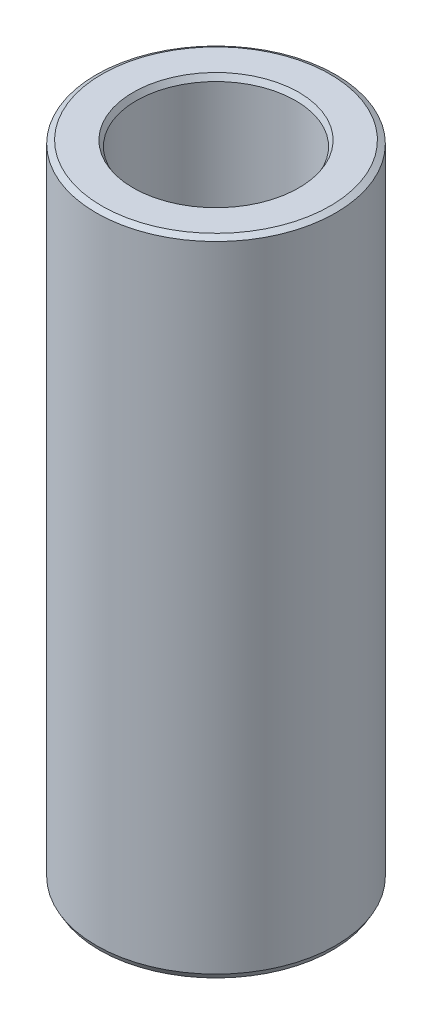
ISO-10303-21;
HEADER;
FILE_DESCRIPTION(('STEP AP214'),'2;1');
FILE_NAME('part.step','',(''),(''),'','','');
FILE_SCHEMA(('AUTOMOTIVE_DESIGN { 1 0 10303 214 1 1 1 1 }'));
ENDSEC;
DATA;
#1=APPLICATION_CONTEXT('core data for automotive mechanical design processes');
#2=APPLICATION_PROTOCOL_DEFINITION('international standard','automotive_design',2000,#1);
#3=PRODUCT_CONTEXT('',#1,'mechanical');
#4=PRODUCT('Part','Part','',(#3));
#5=PRODUCT_RELATED_PRODUCT_CATEGORY('part','',(#4));
#6=PRODUCT_DEFINITION_FORMATION('','',#4);
#7=PRODUCT_DEFINITION_CONTEXT('part definition',#1,'design');
#8=PRODUCT_DEFINITION('design','',#6,#7);
#9=PRODUCT_DEFINITION_SHAPE('','',#8);
#10=(LENGTH_UNIT() NAMED_UNIT(*) SI_UNIT(.MILLI.,.METRE.));
#11=(NAMED_UNIT(*) PLANE_ANGLE_UNIT() SI_UNIT($,.RADIAN.));
#12=(NAMED_UNIT(*) SI_UNIT($,.STERADIAN.) SOLID_ANGLE_UNIT());
#13=UNCERTAINTY_MEASURE_WITH_UNIT(LENGTH_MEASURE(1.E-05),#10,'distance_accuracy_value','');
#14=(GEOMETRIC_REPRESENTATION_CONTEXT(3) GLOBAL_UNCERTAINTY_ASSIGNED_CONTEXT((#13)) GLOBAL_UNIT_ASSIGNED_CONTEXT((#10,
#11,#12)) REPRESENTATION_CONTEXT('',''));
#15=CARTESIAN_POINT('',(0.,0.,0.));
#16=DIRECTION('',(0.,0.,1.));
#17=DIRECTION('',(1.,0.,0.));
#18=AXIS2_PLACEMENT_3D('',#15,#16,#17);
#19=CARTESIAN_POINT('',(0.,134.269833569963,0.));
#20=DIRECTION('',(0.,-1.,0.));
#21=DIRECTION('',(0.,0.,-1.));
#22=AXIS2_PLACEMENT_3D('',#19,#20,#21);
#23=CYLINDRICAL_SURFACE('',#22,25.);
#24=CARTESIAN_POINT('',(0.,1.16628326108606,0.));
#25=DIRECTION('',(0.,1.,0.));
#26=DIRECTION('',(0.,0.,1.));
#27=AXIS2_PLACEMENT_3D('',#24,#25,#26);
#28=CIRCLE('',#27,25.);
#29=CARTESIAN_POINT('',(0.,1.16628326108606,25.));
#30=VERTEX_POINT('',#29);
#31=EDGE_CURVE('E10',#30,#30,#28,.T.);
#32=ORIENTED_EDGE('',*,*,#31,.T.);
#33=EDGE_LOOP('',(#32));
#34=FACE_BOUND('',#33,.T.);
#35=CARTESIAN_POINT('',(0.,133.605547973503,0.));
#36=DIRECTION('',(0.,1.,0.));
#37=DIRECTION('',(0.,0.,1.));
#38=AXIS2_PLACEMENT_3D('',#35,#36,#37);
#39=CIRCLE('',#38,25.);
#40=CARTESIAN_POINT('',(0.,133.605547973503,25.));
#41=VERTEX_POINT('',#40);
#42=EDGE_CURVE('E50',#41,#41,#39,.F.);
#43=ORIENTED_EDGE('',*,*,#42,.T.);
#44=EDGE_LOOP('',(#43));
#45=FACE_BOUND('',#44,.T.);
#46=ADVANCED_FACE('F39',(#34,#45),#23,.T.);
#47=CARTESIAN_POINT('',(0.,134.269833569963,0.));
#48=DIRECTION('',(0.,1.,0.));
#49=DIRECTION('',(0.,0.,1.));
#50=AXIS2_PLACEMENT_3D('',#47,#48,#49);
#51=PLANE('',#50);
#52=CARTESIAN_POINT('',(0.,134.269833569963,0.));
#53=DIRECTION('',(0.,1.,0.));
#54=DIRECTION('',(0.,0.,1.));
#55=AXIS2_PLACEMENT_3D('',#52,#53,#54);
#56=CIRCLE('',#55,17.2913732807012);
#57=CARTESIAN_POINT('',(0.,134.269833569963,17.2913732807012));
#58=VERTEX_POINT('',#57);
#59=EDGE_CURVE('E58',#58,#58,#56,.F.);
#60=ORIENTED_EDGE('',*,*,#59,.T.);
#61=EDGE_LOOP('',(#60));
#62=FACE_BOUND('',#61,.T.);
#63=CARTESIAN_POINT('',(0.,134.269833569963,0.));
#64=DIRECTION('',(0.,1.,0.));
#65=DIRECTION('',(0.,0.,1.));
#66=AXIS2_PLACEMENT_3D('',#63,#64,#65);
#67=CIRCLE('',#66,23.8337167389139);
#68=CARTESIAN_POINT('',(0.,134.269833569963,23.8337167389139));
#69=VERTEX_POINT('',#68);
#70=EDGE_CURVE('E61',#69,#69,#67,.T.);
#71=ORIENTED_EDGE('',*,*,#70,.T.);
#72=EDGE_LOOP('',(#71));
#73=FACE_BOUND('',#72,.T.);
#74=ADVANCED_FACE('F88',(#62,#73),#51,.T.);
#75=CARTESIAN_POINT('',(0.,0.,0.));
#76=DIRECTION('',(0.,1.,0.));
#77=DIRECTION('',(0.,0.,1.));
#78=AXIS2_PLACEMENT_3D('',#75,#76,#77);
#79=PLANE('',#78);
#80=CARTESIAN_POINT('',(0.,0.,0.));
#81=DIRECTION('',(0.,1.,0.));
#82=DIRECTION('',(0.,0.,1.));
#83=AXIS2_PLACEMENT_3D('',#80,#81,#82);
#84=CIRCLE('',#83,17.7933709453277);
#85=CARTESIAN_POINT('',(0.,0.,17.7933709453277));
#86=VERTEX_POINT('',#85);
#87=EDGE_CURVE('E51',#86,#86,#84,.T.);
#88=ORIENTED_EDGE('',*,*,#87,.T.);
#89=EDGE_LOOP('',(#88));
#90=FACE_BOUND('',#89,.T.);
#91=CARTESIAN_POINT('',(0.,0.,0.));
#92=DIRECTION('',(0.,1.,0.));
#93=DIRECTION('',(0.,0.,1.));
#94=AXIS2_PLACEMENT_3D('',#91,#92,#93);
#95=CIRCLE('',#94,24.3357144035404);
#96=CARTESIAN_POINT('',(0.,0.,24.3357144035404));
#97=VERTEX_POINT('',#96);
#98=EDGE_CURVE('E54',#97,#97,#95,.F.);
#99=ORIENTED_EDGE('',*,*,#98,.T.);
#100=EDGE_LOOP('',(#99));
#101=FACE_BOUND('',#100,.T.);
#102=ADVANCED_FACE('F83',(#90,#101),#79,.F.);
#103=CARTESIAN_POINT('',(0.,134.269833569963,0.));
#104=DIRECTION('',(0.,-1.,0.));
#105=DIRECTION('',(0.,0.,-1.));
#106=AXIS2_PLACEMENT_3D('',#103,#104,#105);
#107=CYLINDRICAL_SURFACE('',#106,16.6270876842416);
#108=CARTESIAN_POINT('',(0.,133.103550308877,0.));
#109=DIRECTION('',(0.,1.,0.));
#110=DIRECTION('',(0.,0.,1.));
#111=AXIS2_PLACEMENT_3D('',#108,#109,#110);
#112=CIRCLE('',#111,16.6270876842416);
#113=CARTESIAN_POINT('',(0.,133.103550308877,16.6270876842416));
#114=VERTEX_POINT('',#113);
#115=EDGE_CURVE('E67',#114,#114,#112,.T.);
#116=ORIENTED_EDGE('',*,*,#115,.T.);
#117=EDGE_LOOP('',(#116));
#118=FACE_BOUND('',#117,.T.);
#119=CARTESIAN_POINT('',(0.,0.664285596459646,0.));
#120=DIRECTION('',(0.,1.,0.));
#121=DIRECTION('',(0.,0.,1.));
#122=AXIS2_PLACEMENT_3D('',#119,#120,#121);
#123=CIRCLE('',#122,16.6270876842416);
#124=CARTESIAN_POINT('',(0.,0.664285596459646,16.6270876842416));
#125=VERTEX_POINT('',#124);
#126=EDGE_CURVE('E69',#125,#125,#123,.F.);
#127=ORIENTED_EDGE('',*,*,#126,.T.);
#128=EDGE_LOOP('',(#127));
#129=FACE_BOUND('',#128,.T.);
#130=ADVANCED_FACE('F71',(#118,#129),#107,.F.);
#131=CARTESIAN_POINT('',(0.,133.103550308877,0.));
#132=DIRECTION('',(0.,1.,0.));
#133=DIRECTION('',(0.,0.,1.));
#134=AXIS2_PLACEMENT_3D('',#131,#132,#133);
#135=CONICAL_SURFACE('',#134,16.6270876842416,0.51774756659443);
#136=ORIENTED_EDGE('',*,*,#59,.F.);
#137=EDGE_LOOP('',(#136));
#138=FACE_BOUND('',#137,.T.);
#139=ORIENTED_EDGE('',*,*,#115,.F.);
#140=EDGE_LOOP('',(#139));
#141=FACE_BOUND('',#140,.T.);
#142=ADVANCED_FACE('F77',(#138,#141),#135,.F.);
#143=CARTESIAN_POINT('',(0.,0.,0.));
#144=DIRECTION('',(0.,-1.,0.));
#145=DIRECTION('',(0.,0.,-1.));
#146=AXIS2_PLACEMENT_3D('',#143,#144,#145);
#147=CONICAL_SURFACE('',#146,17.7933709453277,1.05304876020045);
#148=ORIENTED_EDGE('',*,*,#126,.F.);
#149=EDGE_LOOP('',(#148));
#150=FACE_BOUND('',#149,.T.);
#151=ORIENTED_EDGE('',*,*,#87,.F.);
#152=EDGE_LOOP('',(#151));
#153=FACE_BOUND('',#152,.T.);
#154=ADVANCED_FACE('F73',(#150,#153),#147,.F.);
#155=CARTESIAN_POINT('',(0.,1.16628326108606,0.));
#156=DIRECTION('',(0.,1.,0.));
#157=DIRECTION('',(0.,0.,1.));
#158=AXIS2_PLACEMENT_3D('',#155,#156,#157);
#159=CONICAL_SURFACE('',#158,25.,0.517747566594441);
#160=ORIENTED_EDGE('',*,*,#98,.F.);
#161=EDGE_LOOP('',(#160));
#162=FACE_BOUND('',#161,.T.);
#163=ORIENTED_EDGE('',*,*,#31,.F.);
#164=EDGE_LOOP('',(#163));
#165=FACE_BOUND('',#164,.T.);
#166=ADVANCED_FACE('F76',(#162,#165),#159,.T.);
#167=CARTESIAN_POINT('',(0.,134.269833569963,0.));
#168=DIRECTION('',(0.,-1.,0.));
#169=DIRECTION('',(0.,0.,-1.));
#170=AXIS2_PLACEMENT_3D('',#167,#168,#169);
#171=CONICAL_SURFACE('',#170,23.8337167389139,1.05304876020047);
#172=ORIENTED_EDGE('',*,*,#42,.F.);
#173=EDGE_LOOP('',(#172));
#174=FACE_BOUND('',#173,.T.);
#175=ORIENTED_EDGE('',*,*,#70,.F.);
#176=EDGE_LOOP('',(#175));
#177=FACE_BOUND('',#176,.T.);
#178=ADVANCED_FACE('F45',(#174,#177),#171,.T.);
#179=CLOSED_SHELL('',(#46,#74,#102,#130,#142,#154,#166,#178));
#180=MANIFOLD_SOLID_BREP('B2',#179);
#181=ADVANCED_BREP_SHAPE_REPRESENTATION('',(#18,#180),#14);
#182=SHAPE_DEFINITION_REPRESENTATION(#9,#181);
ENDSEC;
END-ISO-10303-21;
